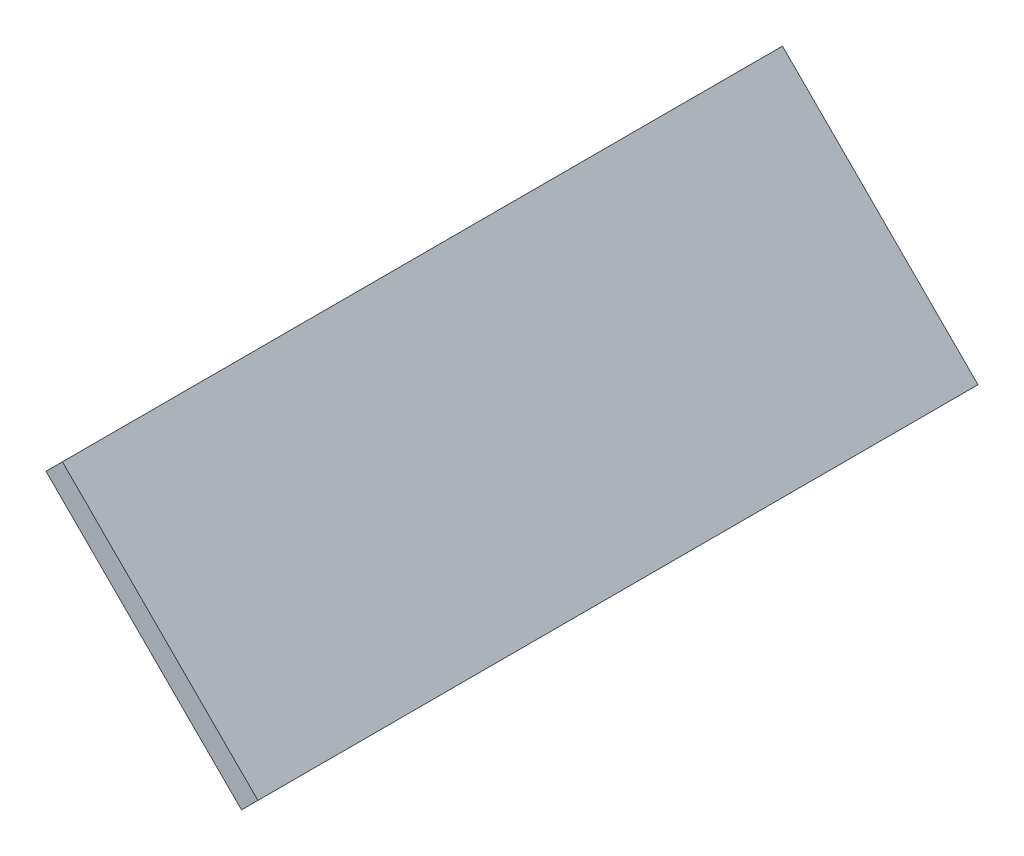
ISO-10303-21;
HEADER;
FILE_DESCRIPTION(('STEP AP214'),'2;1');
FILE_NAME('part.step','',(''),(''),'','','');
FILE_SCHEMA(('AUTOMOTIVE_DESIGN { 1 0 10303 214 1 1 1 1 }'));
ENDSEC;
DATA;
#1=APPLICATION_CONTEXT('core data for automotive mechanical design processes');
#2=APPLICATION_PROTOCOL_DEFINITION('international standard','automotive_design',2000,#1);
#3=PRODUCT_CONTEXT('',#1,'mechanical');
#4=PRODUCT('Part','Part','',(#3));
#5=PRODUCT_RELATED_PRODUCT_CATEGORY('part','',(#4));
#6=PRODUCT_DEFINITION_FORMATION('','',#4);
#7=PRODUCT_DEFINITION_CONTEXT('part definition',#1,'design');
#8=PRODUCT_DEFINITION('design','',#6,#7);
#9=PRODUCT_DEFINITION_SHAPE('','',#8);
#10=(LENGTH_UNIT() NAMED_UNIT(*) SI_UNIT(.MILLI.,.METRE.));
#11=(NAMED_UNIT(*) PLANE_ANGLE_UNIT() SI_UNIT($,.RADIAN.));
#12=(NAMED_UNIT(*) SI_UNIT($,.STERADIAN.) SOLID_ANGLE_UNIT());
#13=UNCERTAINTY_MEASURE_WITH_UNIT(LENGTH_MEASURE(1.E-05),#10,'distance_accuracy_value','');
#14=(GEOMETRIC_REPRESENTATION_CONTEXT(3) GLOBAL_UNCERTAINTY_ASSIGNED_CONTEXT((#13)) GLOBAL_UNIT_ASSIGNED_CONTEXT((#10,
#11,#12)) REPRESENTATION_CONTEXT('',''));
#15=CARTESIAN_POINT('',(0.,0.,0.));
#16=DIRECTION('',(0.,0.,1.));
#17=DIRECTION('',(1.,0.,0.));
#18=AXIS2_PLACEMENT_3D('',#15,#16,#17);
#19=CARTESIAN_POINT('',(19.0472746403787,-8.64157273417656,13.2300686377747));
#20=DIRECTION('',(-0.707106781186544,0.707106781186551,0.));
#21=DIRECTION('',(-0.707106781186551,-0.707106781186544,0.));
#22=AXIS2_PLACEMENT_3D('',#19,#20,#21);
#23=PLANE('',#22);
#24=DIRECTION('',(0.,0.,-1.));
#25=VECTOR('',#24,1.);
#26=CARTESIAN_POINT('',(18.5451307940586,-9.14371658049665,13.2300686377747));
#27=LINE('',#26,#25);
#28=CARTESIAN_POINT('',(18.5451307940586,-9.14371658049665,13.2300686377747));
#29=VERTEX_POINT('',#28);
#30=CARTESIAN_POINT('',(18.5451307940586,-9.14371658049665,-8.80124804167504));
#31=VERTEX_POINT('',#30);
#32=EDGE_CURVE('E79',#29,#31,#27,.T.);
#33=ORIENTED_EDGE('',*,*,#32,.F.);
#34=DIRECTION('',(-0.707106781186551,-0.707106781186544,0.));
#35=VECTOR('',#34,1.);
#36=CARTESIAN_POINT('',(19.0472746403787,-8.64157273417657,13.2300686377747));
#37=LINE('',#36,#35);
#38=CARTESIAN_POINT('',(19.0472746403787,-8.64157273417657,13.2300686377747));
#39=VERTEX_POINT('',#38);
#40=EDGE_CURVE('E32',#39,#29,#37,.T.);
#41=ORIENTED_EDGE('',*,*,#40,.F.);
#42=DIRECTION('',(0.,0.,-1.));
#43=VECTOR('',#42,1.);
#44=CARTESIAN_POINT('',(19.0472746403787,-8.64157273417656,13.2300686377747));
#45=LINE('',#44,#43);
#46=CARTESIAN_POINT('',(19.0472746403787,-8.64157273417656,-8.80124804167504));
#47=VERTEX_POINT('',#46);
#48=EDGE_CURVE('E71',#39,#47,#45,.T.);
#49=ORIENTED_EDGE('',*,*,#48,.T.);
#50=DIRECTION('',(-0.707106781186551,-0.707106781186544,0.));
#51=VECTOR('',#50,1.);
#52=CARTESIAN_POINT('',(19.0472746403787,-8.64157273417656,-8.80124804167504));
#53=LINE('',#52,#51);
#54=EDGE_CURVE('E10',#47,#31,#53,.T.);
#55=ORIENTED_EDGE('',*,*,#54,.T.);
#56=EDGE_LOOP('',(#33,#41,#49,#55));
#57=FACE_BOUND('',#56,.T.);
#58=ADVANCED_FACE('F16',(#57),#23,.T.);
#59=CARTESIAN_POINT('',(19.0472746403787,-8.64157273417656,-8.80124804167504));
#60=DIRECTION('',(0.,0.,-1.));
#61=DIRECTION('',(-1.,0.,0.));
#62=AXIS2_PLACEMENT_3D('',#59,#60,#61);
#63=PLANE('',#62);
#64=DIRECTION('',(0.707106781186544,-0.707106781186551,0.));
#65=VECTOR('',#64,1.);
#66=CARTESIAN_POINT('',(18.5451307940586,-9.14371658049665,-8.80124804167504));
#67=LINE('',#66,#65);
#68=CARTESIAN_POINT('',(24.5273512313687,-15.1259370178068,-8.80124804167504));
#69=VERTEX_POINT('',#68);
#70=EDGE_CURVE('E82',#31,#69,#67,.T.);
#71=ORIENTED_EDGE('',*,*,#70,.F.);
#72=ORIENTED_EDGE('',*,*,#54,.F.);
#73=DIRECTION('',(0.707106781186544,-0.707106781186551,0.));
#74=VECTOR('',#73,1.);
#75=CARTESIAN_POINT('',(19.0472746403787,-8.64157273417656,-8.80124804167504));
#76=LINE('',#75,#74);
#77=CARTESIAN_POINT('',(25.0294950776888,-14.6237931714867,-8.80124804167504));
#78=VERTEX_POINT('',#77);
#79=EDGE_CURVE('E67',#47,#78,#76,.T.);
#80=ORIENTED_EDGE('',*,*,#79,.T.);
#81=DIRECTION('',(-0.707106781186551,-0.707106781186544,0.));
#82=VECTOR('',#81,1.);
#83=CARTESIAN_POINT('',(25.0294950776888,-14.6237931714867,-8.80124804167504));
#84=LINE('',#83,#82);
#85=EDGE_CURVE('E24',#78,#69,#84,.T.);
#86=ORIENTED_EDGE('',*,*,#85,.T.);
#87=EDGE_LOOP('',(#71,#72,#80,#86));
#88=FACE_BOUND('',#87,.T.);
#89=ADVANCED_FACE('F68',(#88),#63,.T.);
#90=CARTESIAN_POINT('',(25.0294950776888,-14.6237931714867,-8.80124804167504));
#91=DIRECTION('',(0.707106781186544,-0.707106781186551,0.));
#92=DIRECTION('',(0.707106781186551,0.707106781186544,0.));
#93=AXIS2_PLACEMENT_3D('',#90,#91,#92);
#94=PLANE('',#93);
#95=DIRECTION('',(0.,0.,1.));
#96=VECTOR('',#95,1.);
#97=CARTESIAN_POINT('',(24.5273512313687,-15.1259370178068,-8.80124804167504));
#98=LINE('',#97,#96);
#99=CARTESIAN_POINT('',(24.5273512313687,-15.1259370178068,13.2300686377747));
#100=VERTEX_POINT('',#99);
#101=EDGE_CURVE('E65',#69,#100,#98,.T.);
#102=ORIENTED_EDGE('',*,*,#101,.F.);
#103=ORIENTED_EDGE('',*,*,#85,.F.);
#104=DIRECTION('',(0.,0.,1.));
#105=VECTOR('',#104,1.);
#106=CARTESIAN_POINT('',(25.0294950776888,-14.6237931714867,-8.80124804167504));
#107=LINE('',#106,#105);
#108=CARTESIAN_POINT('',(25.0294950776888,-14.6237931714867,13.2300686377747));
#109=VERTEX_POINT('',#108);
#110=EDGE_CURVE('E62',#78,#109,#107,.T.);
#111=ORIENTED_EDGE('',*,*,#110,.T.);
#112=DIRECTION('',(-0.707106781186551,-0.707106781186544,0.));
#113=VECTOR('',#112,1.);
#114=CARTESIAN_POINT('',(25.0294950776888,-14.6237931714867,13.2300686377747));
#115=LINE('',#114,#113);
#116=EDGE_CURVE('E48',#109,#100,#115,.T.);
#117=ORIENTED_EDGE('',*,*,#116,.T.);
#118=EDGE_LOOP('',(#102,#103,#111,#117));
#119=FACE_BOUND('',#118,.T.);
#120=ADVANCED_FACE('F60',(#119),#94,.T.);
#121=CARTESIAN_POINT('',(25.0294950776888,-14.6237931714867,13.2300686377747));
#122=DIRECTION('',(0.,0.,1.));
#123=DIRECTION('',(0.,-1.,0.));
#124=AXIS2_PLACEMENT_3D('',#121,#122,#123);
#125=PLANE('',#124);
#126=DIRECTION('',(-0.707106781186544,0.707106781186551,0.));
#127=VECTOR('',#126,1.);
#128=CARTESIAN_POINT('',(24.5273512313687,-15.1259370178068,13.2300686377747));
#129=LINE('',#128,#127);
#130=EDGE_CURVE('E85',#100,#29,#129,.T.);
#131=ORIENTED_EDGE('',*,*,#130,.F.);
#132=ORIENTED_EDGE('',*,*,#116,.F.);
#133=DIRECTION('',(-0.707106781186544,0.707106781186551,0.));
#134=VECTOR('',#133,1.);
#135=CARTESIAN_POINT('',(25.0294950776888,-14.6237931714867,13.2300686377747));
#136=LINE('',#135,#134);
#137=EDGE_CURVE('E74',#109,#39,#136,.T.);
#138=ORIENTED_EDGE('',*,*,#137,.T.);
#139=ORIENTED_EDGE('',*,*,#40,.T.);
#140=EDGE_LOOP('',(#131,#132,#138,#139));
#141=FACE_BOUND('',#140,.T.);
#142=ADVANCED_FACE('F96',(#141),#125,.T.);
#143=CARTESIAN_POINT('',(24.8668119837799,-14.4611100775778,0.5));
#144=DIRECTION('',(-0.707106781186551,-0.707106781186544,0.));
#145=DIRECTION('',(0.707106781186544,-0.707106781186551,0.));
#146=AXIS2_PLACEMENT_3D('',#143,#144,#145);
#147=PLANE('',#146);
#148=ORIENTED_EDGE('',*,*,#48,.F.);
#149=ORIENTED_EDGE('',*,*,#137,.F.);
#150=ORIENTED_EDGE('',*,*,#110,.F.);
#151=ORIENTED_EDGE('',*,*,#79,.F.);
#152=EDGE_LOOP('',(#148,#149,#150,#151));
#153=FACE_BOUND('',#152,.T.);
#154=ADVANCED_FACE('F73',(#153),#147,.F.);
#155=CARTESIAN_POINT('',(24.3646681374598,-14.9632539238979,0.5));
#156=DIRECTION('',(-0.707106781186551,-0.707106781186544,0.));
#157=DIRECTION('',(0.707106781186544,-0.707106781186551,0.));
#158=AXIS2_PLACEMENT_3D('',#155,#156,#157);
#159=PLANE('',#158);
#160=ORIENTED_EDGE('',*,*,#32,.T.);
#161=ORIENTED_EDGE('',*,*,#70,.T.);
#162=ORIENTED_EDGE('',*,*,#101,.T.);
#163=ORIENTED_EDGE('',*,*,#130,.T.);
#164=EDGE_LOOP('',(#160,#161,#162,#163));
#165=FACE_BOUND('',#164,.T.);
#166=ADVANCED_FACE('F89',(#165),#159,.T.);
#167=CLOSED_SHELL('',(#58,#89,#120,#142,#154,#166));
#168=MANIFOLD_SOLID_BREP('B1',#167);
#169=ADVANCED_BREP_SHAPE_REPRESENTATION('',(#18,#168),#14);
#170=SHAPE_DEFINITION_REPRESENTATION(#9,#169);
ENDSEC;
END-ISO-10303-21;
